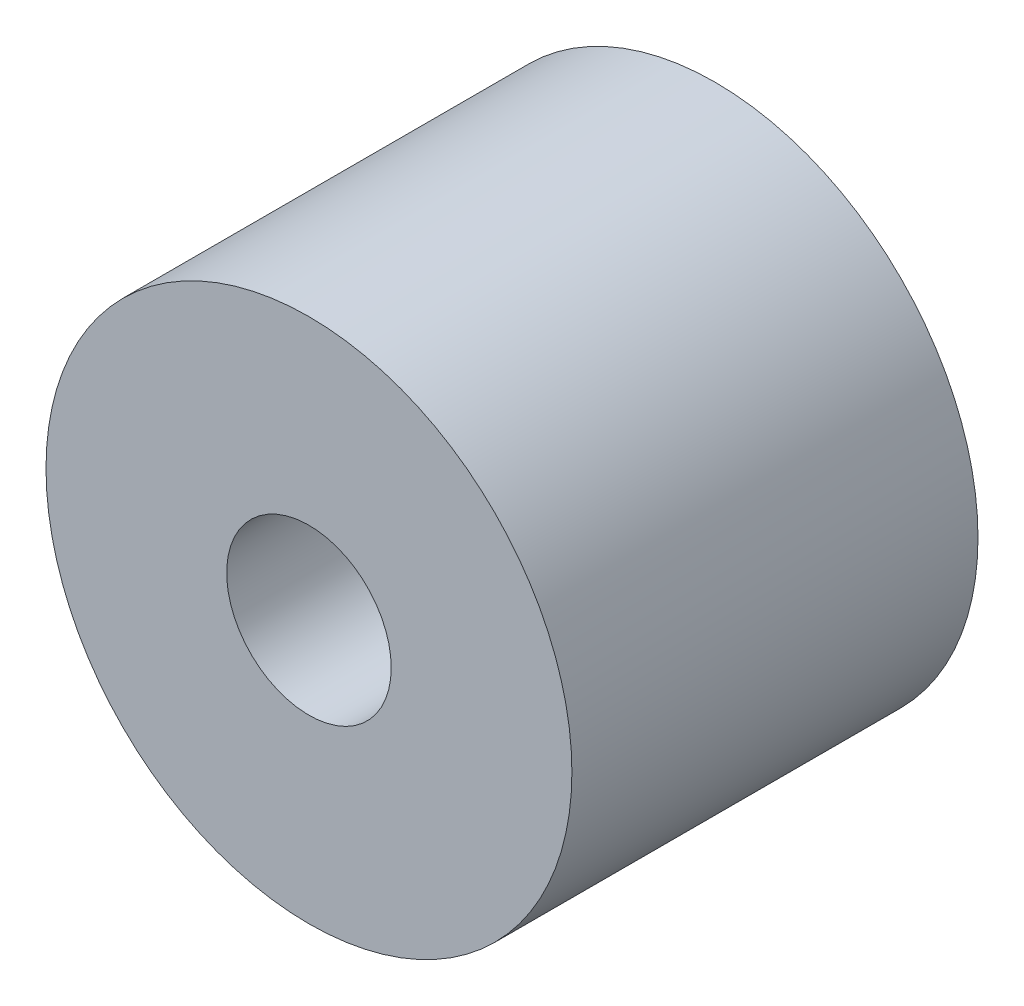
ISO-10303-21;
HEADER;
FILE_DESCRIPTION(('STEP AP214'),'2;1');
FILE_NAME('part.step','',(''),(''),'','','');
FILE_SCHEMA(('AUTOMOTIVE_DESIGN { 1 0 10303 214 1 1 1 1 }'));
ENDSEC;
DATA;
#1=APPLICATION_CONTEXT('core data for automotive mechanical design processes');
#2=APPLICATION_PROTOCOL_DEFINITION('international standard','automotive_design',2000,#1);
#3=PRODUCT_CONTEXT('',#1,'mechanical');
#4=PRODUCT('Part','Part','',(#3));
#5=PRODUCT_RELATED_PRODUCT_CATEGORY('part','',(#4));
#6=PRODUCT_DEFINITION_FORMATION('','',#4);
#7=PRODUCT_DEFINITION_CONTEXT('part definition',#1,'design');
#8=PRODUCT_DEFINITION('design','',#6,#7);
#9=PRODUCT_DEFINITION_SHAPE('','',#8);
#10=(LENGTH_UNIT() NAMED_UNIT(*) SI_UNIT(.MILLI.,.METRE.));
#11=(NAMED_UNIT(*) PLANE_ANGLE_UNIT() SI_UNIT($,.RADIAN.));
#12=(NAMED_UNIT(*) SI_UNIT($,.STERADIAN.) SOLID_ANGLE_UNIT());
#13=UNCERTAINTY_MEASURE_WITH_UNIT(LENGTH_MEASURE(1.E-05),#10,'distance_accuracy_value','');
#14=(GEOMETRIC_REPRESENTATION_CONTEXT(3) GLOBAL_UNCERTAINTY_ASSIGNED_CONTEXT((#13)) GLOBAL_UNIT_ASSIGNED_CONTEXT((#10,
#11,#12)) REPRESENTATION_CONTEXT('',''));
#15=CARTESIAN_POINT('',(0.,0.,0.));
#16=DIRECTION('',(0.,0.,1.));
#17=DIRECTION('',(1.,0.,0.));
#18=AXIS2_PLACEMENT_3D('',#15,#16,#17);
#19=CARTESIAN_POINT('',(0.,0.,1.07811148401625));
#20=DIRECTION('',(0.,0.,-1.));
#21=DIRECTION('',(-1.,0.,0.));
#22=AXIS2_PLACEMENT_3D('',#19,#20,#21);
#23=PLANE('',#22);
#24=CARTESIAN_POINT('',(0.,0.,1.07811148401625));
#25=DIRECTION('',(0.,0.,1.));
#26=DIRECTION('',(1.,0.,0.));
#27=AXIS2_PLACEMENT_3D('',#24,#25,#26);
#28=CIRCLE('',#27,0.964243112126478);
#29=CARTESIAN_POINT('',(0.964243112126478,0.,1.07811148401625));
#30=VERTEX_POINT('',#29);
#31=EDGE_CURVE('E18',#30,#30,#28,.T.);
#32=ORIENTED_EDGE('',*,*,#31,.T.);
#33=EDGE_LOOP('',(#32));
#34=FACE_BOUND('',#33,.T.);
#35=ADVANCED_FACE('F15',(#34),#23,.F.);
#36=CARTESIAN_POINT('',(0.,0.,1.07811148401625));
#37=DIRECTION('',(0.,0.,1.));
#38=DIRECTION('',(1.,0.,0.));
#39=AXIS2_PLACEMENT_3D('',#36,#37,#38);
#40=CYLINDRICAL_SURFACE('',#39,0.964243112126478);
#41=CARTESIAN_POINT('',(0.,0.,4.75904305856718));
#42=DIRECTION('',(0.,0.,1.));
#43=DIRECTION('',(1.,0.,0.));
#44=AXIS2_PLACEMENT_3D('',#41,#42,#43);
#45=CIRCLE('',#44,0.964243112126478);
#46=CARTESIAN_POINT('',(0.964243112126478,0.,4.75904305856718));
#47=VERTEX_POINT('',#46);
#48=EDGE_CURVE('E27',#47,#47,#45,.F.);
#49=ORIENTED_EDGE('',*,*,#48,.F.);
#50=EDGE_LOOP('',(#49));
#51=FACE_BOUND('',#50,.T.);
#52=ORIENTED_EDGE('',*,*,#31,.F.);
#53=EDGE_LOOP('',(#52));
#54=FACE_BOUND('',#53,.T.);
#55=ADVANCED_FACE('F36',(#51,#54),#40,.F.);
#56=CARTESIAN_POINT('',(0.,0.,4.75904305856718));
#57=DIRECTION('',(0.,0.,1.));
#58=DIRECTION('',(1.,0.,0.));
#59=AXIS2_PLACEMENT_3D('',#56,#57,#58);
#60=PLANE('',#59);
#61=ORIENTED_EDGE('',*,*,#48,.T.);
#62=EDGE_LOOP('',(#61));
#63=FACE_BOUND('',#62,.T.);
#64=CARTESIAN_POINT('',(0.,0.,4.75904305856718));
#65=DIRECTION('',(0.,0.,-1.));
#66=DIRECTION('',(-1.,0.,0.));
#67=AXIS2_PLACEMENT_3D('',#64,#65,#66);
#68=CIRCLE('',#67,3.0816009626305);
#69=CARTESIAN_POINT('',(-3.0816009626305,0.,4.75904305856718));
#70=VERTEX_POINT('',#69);
#71=EDGE_CURVE('E22',#70,#70,#68,.T.);
#72=ORIENTED_EDGE('',*,*,#71,.F.);
#73=EDGE_LOOP('',(#72));
#74=FACE_BOUND('',#73,.T.);
#75=ADVANCED_FACE('F38',(#63,#74),#60,.T.);
#76=CARTESIAN_POINT('',(0.,0.,0.));
#77=DIRECTION('',(0.,0.,1.));
#78=DIRECTION('',(1.,0.,0.));
#79=AXIS2_PLACEMENT_3D('',#76,#77,#78);
#80=PLANE('',#79);
#81=CARTESIAN_POINT('',(0.,0.,0.));
#82=DIRECTION('',(0.,0.,-1.));
#83=DIRECTION('',(-1.,0.,0.));
#84=AXIS2_PLACEMENT_3D('',#81,#82,#83);
#85=CIRCLE('',#84,3.0816009626305);
#86=CARTESIAN_POINT('',(-3.0816009626305,0.,0.));
#87=VERTEX_POINT('',#86);
#88=EDGE_CURVE('E10',#87,#87,#85,.F.);
#89=ORIENTED_EDGE('',*,*,#88,.F.);
#90=EDGE_LOOP('',(#89));
#91=FACE_BOUND('',#90,.T.);
#92=ADVANCED_FACE('F45',(#91),#80,.F.);
#93=CARTESIAN_POINT('',(0.,0.,4.75904305856718));
#94=DIRECTION('',(0.,0.,-1.));
#95=DIRECTION('',(-1.,0.,0.));
#96=AXIS2_PLACEMENT_3D('',#93,#94,#95);
#97=CYLINDRICAL_SURFACE('',#96,3.0816009626305);
#98=ORIENTED_EDGE('',*,*,#88,.T.);
#99=EDGE_LOOP('',(#98));
#100=FACE_BOUND('',#99,.T.);
#101=ORIENTED_EDGE('',*,*,#71,.T.);
#102=EDGE_LOOP('',(#101));
#103=FACE_BOUND('',#102,.T.);
#104=ADVANCED_FACE('F47',(#100,#103),#97,.T.);
#105=CLOSED_SHELL('',(#35,#55,#75,#92,#104));
#106=MANIFOLD_SOLID_BREP('B1',#105);
#107=ADVANCED_BREP_SHAPE_REPRESENTATION('',(#18,#106),#14);
#108=SHAPE_DEFINITION_REPRESENTATION(#9,#107);
ENDSEC;
END-ISO-10303-21;
